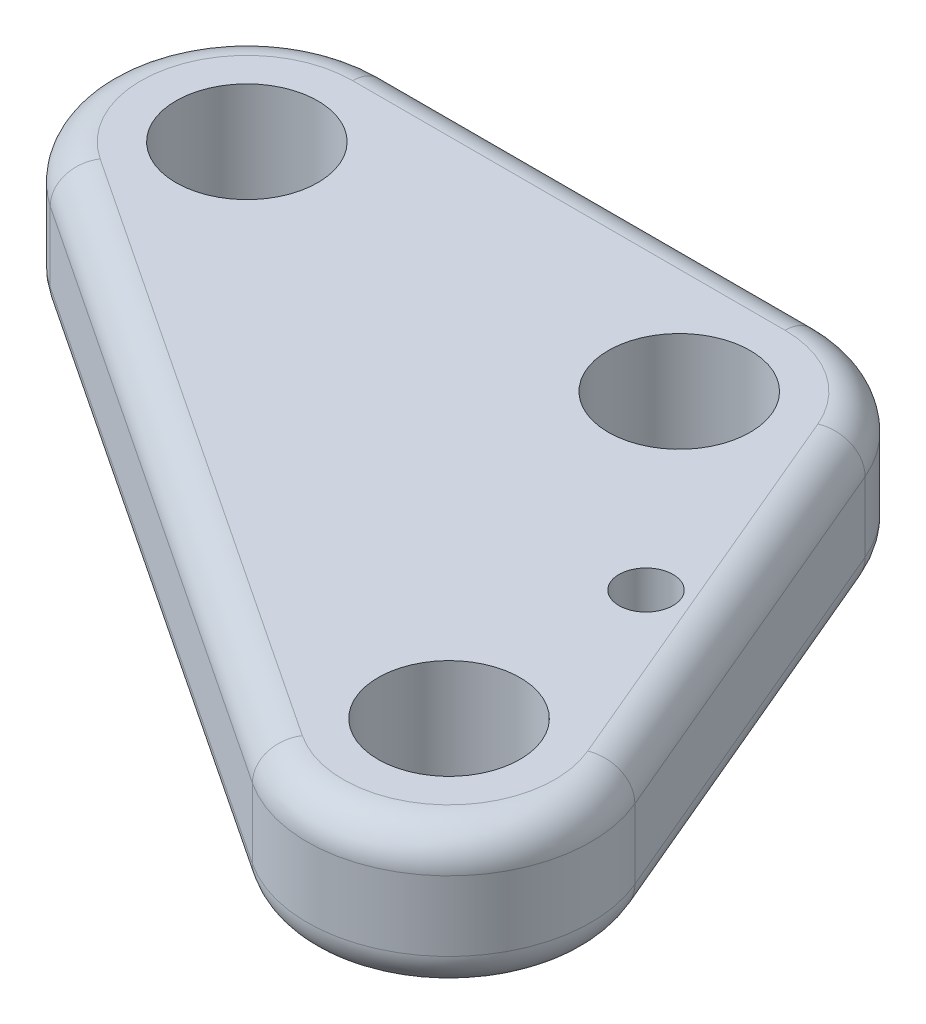
ISO-10303-21;
HEADER;
FILE_DESCRIPTION(('STEP AP214'),'2;1');
FILE_NAME('part.step','',(''),(''),'','','');
FILE_SCHEMA(('AUTOMOTIVE_DESIGN { 1 0 10303 214 1 1 1 1 }'));
ENDSEC;
DATA;
#1=APPLICATION_CONTEXT('core data for automotive mechanical design processes');
#2=APPLICATION_PROTOCOL_DEFINITION('international standard','automotive_design',2000,#1);
#3=PRODUCT_CONTEXT('',#1,'mechanical');
#4=PRODUCT('Part','Part','',(#3));
#5=PRODUCT_RELATED_PRODUCT_CATEGORY('part','',(#4));
#6=PRODUCT_DEFINITION_FORMATION('','',#4);
#7=PRODUCT_DEFINITION_CONTEXT('part definition',#1,'design');
#8=PRODUCT_DEFINITION('design','',#6,#7);
#9=PRODUCT_DEFINITION_SHAPE('','',#8);
#10=(LENGTH_UNIT() NAMED_UNIT(*) SI_UNIT(.MILLI.,.METRE.));
#11=(NAMED_UNIT(*) PLANE_ANGLE_UNIT() SI_UNIT($,.RADIAN.));
#12=(NAMED_UNIT(*) SI_UNIT($,.STERADIAN.) SOLID_ANGLE_UNIT());
#13=UNCERTAINTY_MEASURE_WITH_UNIT(LENGTH_MEASURE(1.E-05),#10,'distance_accuracy_value','');
#14=(GEOMETRIC_REPRESENTATION_CONTEXT(3) GLOBAL_UNCERTAINTY_ASSIGNED_CONTEXT((#13)) GLOBAL_UNIT_ASSIGNED_CONTEXT((#10,
#11,#12)) REPRESENTATION_CONTEXT('',''));
#15=CARTESIAN_POINT('',(0.,0.,0.));
#16=DIRECTION('',(0.,0.,1.));
#17=DIRECTION('',(1.,0.,0.));
#18=AXIS2_PLACEMENT_3D('',#15,#16,#17);
#19=CARTESIAN_POINT('',(-22.4920294512806,8.3,3.50697365111414));
#20=DIRECTION('',(0.,-1.,0.));
#21=DIRECTION('',(0.,0.,-1.));
#22=AXIS2_PLACEMENT_3D('',#19,#20,#21);
#23=PLANE('',#22);
#24=DIRECTION('',(-1.,0.,0.));
#25=VECTOR('',#24,1.);
#26=CARTESIAN_POINT('',(-22.4920294512806,8.3,-1.41662634888586));
#27=LINE('',#26,#25);
#28=CARTESIAN_POINT('',(-2.37522945128062,8.3,-1.41662634888587));
#29=VERTEX_POINT('',#28);
#30=CARTESIAN_POINT('',(-22.4920294512806,8.3,-1.41662634888586));
#31=VERTEX_POINT('',#30);
#32=EDGE_CURVE('E52',#29,#31,#27,.T.);
#33=ORIENTED_EDGE('',*,*,#32,.T.);
#34=CARTESIAN_POINT('',(-22.4920294512806,8.3,3.50697365111414));
#35=DIRECTION('',(0.,-1.,0.));
#36=DIRECTION('',(0.,0.,-1.));
#37=AXIS2_PLACEMENT_3D('',#34,#35,#36);
#38=CIRCLE('',#37,4.9236);
#39=CARTESIAN_POINT('',(-25.2136517542463,8.3,7.60997365111413));
#40=VERTEX_POINT('',#39);
#41=EDGE_CURVE('E135',#31,#40,#38,.F.);
#42=ORIENTED_EDGE('',*,*,#41,.T.);
#43=DIRECTION('',(0.833333333333333,0.,0.552770798392567));
#44=VECTOR('',#43,1.);
#45=CARTESIAN_POINT('',(-25.2136517542463,8.3,7.60997365111413));
#46=LINE('',#45,#44);
#47=CARTESIAN_POINT('',(2.72634824575375,8.3,26.1432729796201));
#48=VERTEX_POINT('',#47);
#49=EDGE_CURVE('E157',#40,#48,#46,.T.);
#50=ORIENTED_EDGE('',*,*,#49,.T.);
#51=CARTESIAN_POINT('',(5.44797054871939,8.3,22.0402729796201));
#52=DIRECTION('',(0.,-1.,0.));
#53=DIRECTION('',(0.,0.,-1.));
#54=AXIS2_PLACEMENT_3D('',#51,#52,#53);
#55=CIRCLE('',#54,4.9236);
#56=CARTESIAN_POINT('',(9.98400772032879,8.3,20.1255396462868));
#57=VERTEX_POINT('',#56);
#58=EDGE_CURVE('E273',#48,#57,#55,.F.);
#59=ORIENTED_EDGE('',*,*,#58,.T.);
#60=DIRECTION('',(-0.388888888888889,0.,-0.921284663987611));
#61=VECTOR('',#60,1.);
#62=CARTESIAN_POINT('',(-0.881547835226778,8.3,-5.61515386552708));
#63=LINE('',#62,#61);
#64=CARTESIAN_POINT('',(2.16080772032878,8.3,1.5922403177808));
#65=VERTEX_POINT('',#64);
#66=EDGE_CURVE('E275',#57,#65,#63,.T.);
#67=ORIENTED_EDGE('',*,*,#66,.T.);
#68=CARTESIAN_POINT('',(-2.37522945128062,8.3,3.50697365111414));
#69=DIRECTION('',(0.,-1.,0.));
#70=DIRECTION('',(0.,0.,-1.));
#71=AXIS2_PLACEMENT_3D('',#68,#69,#70);
#72=CIRCLE('',#71,4.9236);
#73=EDGE_CURVE('E57',#65,#29,#72,.F.);
#74=ORIENTED_EDGE('',*,*,#73,.T.);
#75=EDGE_LOOP('',(#33,#42,#50,#59,#67,#74));
#76=FACE_BOUND('',#75,.T.);
#77=CARTESIAN_POINT('',(-22.4920294512806,8.3,3.50697365111414));
#78=DIRECTION('',(0.,1.,0.));
#79=DIRECTION('',(0.,0.,1.));
#80=AXIS2_PLACEMENT_3D('',#77,#78,#79);
#81=CIRCLE('',#80,3.3);
#82=CARTESIAN_POINT('',(-22.4920294512806,8.3,6.80697365111413));
#83=VERTEX_POINT('',#82);
#84=EDGE_CURVE('E225',#83,#83,#81,.T.);
#85=ORIENTED_EDGE('',*,*,#84,.F.);
#86=EDGE_LOOP('',(#85));
#87=FACE_BOUND('',#86,.T.);
#88=CARTESIAN_POINT('',(-2.37522945128062,8.3,3.50697365111414));
#89=DIRECTION('',(0.,1.,0.));
#90=DIRECTION('',(0.,0.,1.));
#91=AXIS2_PLACEMENT_3D('',#88,#89,#90);
#92=CIRCLE('',#91,3.3);
#93=CARTESIAN_POINT('',(-2.37522945128062,8.3,6.80697365111414));
#94=VERTEX_POINT('',#93);
#95=EDGE_CURVE('E219',#94,#94,#92,.T.);
#96=ORIENTED_EDGE('',*,*,#95,.F.);
#97=EDGE_LOOP('',(#96));
#98=FACE_BOUND('',#97,.T.);
#99=CARTESIAN_POINT('',(5.44797054871939,8.3,22.0402729796201));
#100=DIRECTION('',(0.,1.,0.));
#101=DIRECTION('',(0.,0.,1.));
#102=AXIS2_PLACEMENT_3D('',#99,#100,#101);
#103=CIRCLE('',#102,3.3);
#104=CARTESIAN_POINT('',(5.44797054871939,8.3,25.3402729796201));
#105=VERTEX_POINT('',#104);
#106=EDGE_CURVE('E213',#105,#105,#103,.T.);
#107=ORIENTED_EDGE('',*,*,#106,.F.);
#108=EDGE_LOOP('',(#107));
#109=FACE_BOUND('',#108,.T.);
#110=CARTESIAN_POINT('',(4.85393277628662,8.3,12.2830441207215));
#111=DIRECTION('',(0.,1.,0.));
#112=DIRECTION('',(0.,0.,1.));
#113=AXIS2_PLACEMENT_3D('',#110,#111,#112);
#114=CIRCLE('',#113,1.2573);
#115=CARTESIAN_POINT('',(4.85393277628662,8.3,13.5403441207215));
#116=VERTEX_POINT('',#115);
#117=EDGE_CURVE('E205',#116,#116,#114,.T.);
#118=ORIENTED_EDGE('',*,*,#117,.F.);
#119=EDGE_LOOP('',(#118));
#120=FACE_BOUND('',#119,.T.);
#121=ADVANCED_FACE('F35',(#76,#87,#98,#109,#120),#23,.F.);
#122=CARTESIAN_POINT('',(-22.4920294512806,1.7,3.50697365111414));
#123=DIRECTION('',(0.,-1.,0.));
#124=DIRECTION('',(0.,0.,-1.));
#125=AXIS2_PLACEMENT_3D('',#122,#123,#124);
#126=PLANE('',#125);
#127=DIRECTION('',(0.833333333333333,0.,0.552770798392567));
#128=VECTOR('',#127,1.);
#129=CARTESIAN_POINT('',(-25.2136517542463,1.7,7.60997365111413));
#130=LINE('',#129,#128);
#131=CARTESIAN_POINT('',(2.72634824575375,1.7,26.1432729796201));
#132=VERTEX_POINT('',#131);
#133=CARTESIAN_POINT('',(-25.2136517542463,1.7,7.60997365111413));
#134=VERTEX_POINT('',#133);
#135=EDGE_CURVE('E243',#132,#134,#130,.F.);
#136=ORIENTED_EDGE('',*,*,#135,.T.);
#137=CARTESIAN_POINT('',(-22.4920294512806,1.7,3.50697365111414));
#138=DIRECTION('',(0.,-1.,0.));
#139=DIRECTION('',(0.,0.,-1.));
#140=AXIS2_PLACEMENT_3D('',#137,#138,#139);
#141=CIRCLE('',#140,4.9236);
#142=CARTESIAN_POINT('',(-22.4920294512806,1.7,-1.41662634888586));
#143=VERTEX_POINT('',#142);
#144=EDGE_CURVE('E253',#134,#143,#141,.T.);
#145=ORIENTED_EDGE('',*,*,#144,.T.);
#146=DIRECTION('',(-1.,0.,0.));
#147=VECTOR('',#146,1.);
#148=CARTESIAN_POINT('',(-2.37522945128062,1.7,-1.41662634888586));
#149=LINE('',#148,#147);
#150=CARTESIAN_POINT('',(-2.37522945128062,1.7,-1.41662634888587));
#151=VERTEX_POINT('',#150);
#152=EDGE_CURVE('E251',#143,#151,#149,.F.);
#153=ORIENTED_EDGE('',*,*,#152,.T.);
#154=CARTESIAN_POINT('',(-2.37522945128062,1.7,3.50697365111414));
#155=DIRECTION('',(0.,-1.,0.));
#156=DIRECTION('',(0.,0.,-1.));
#157=AXIS2_PLACEMENT_3D('',#154,#155,#156);
#158=CIRCLE('',#157,4.9236);
#159=CARTESIAN_POINT('',(2.16080772032878,1.7,1.5922403177808));
#160=VERTEX_POINT('',#159);
#161=EDGE_CURVE('E249',#151,#160,#158,.T.);
#162=ORIENTED_EDGE('',*,*,#161,.T.);
#163=DIRECTION('',(-0.388888888888889,0.,-0.921284663987611));
#164=VECTOR('',#163,1.);
#165=CARTESIAN_POINT('',(9.98400772032879,1.7,20.1255396462868));
#166=LINE('',#165,#164);
#167=CARTESIAN_POINT('',(9.98400772032879,1.7,20.1255396462868));
#168=VERTEX_POINT('',#167);
#169=EDGE_CURVE('E247',#160,#168,#166,.F.);
#170=ORIENTED_EDGE('',*,*,#169,.T.);
#171=CARTESIAN_POINT('',(5.44797054871939,1.7,22.0402729796201));
#172=DIRECTION('',(0.,-1.,0.));
#173=DIRECTION('',(0.,0.,-1.));
#174=AXIS2_PLACEMENT_3D('',#171,#172,#173);
#175=CIRCLE('',#174,4.9236);
#176=EDGE_CURVE('E245',#168,#132,#175,.T.);
#177=ORIENTED_EDGE('',*,*,#176,.T.);
#178=EDGE_LOOP('',(#136,#145,#153,#162,#170,#177));
#179=FACE_BOUND('',#178,.T.);
#180=CARTESIAN_POINT('',(5.44797054871939,1.7,22.0402729796201));
#181=DIRECTION('',(0.,1.,0.));
#182=DIRECTION('',(0.,0.,1.));
#183=AXIS2_PLACEMENT_3D('',#180,#181,#182);
#184=CIRCLE('',#183,3.3);
#185=CARTESIAN_POINT('',(5.44797054871939,1.7,25.3402729796201));
#186=VERTEX_POINT('',#185);
#187=EDGE_CURVE('E210',#186,#186,#184,.T.);
#188=ORIENTED_EDGE('',*,*,#187,.T.);
#189=EDGE_LOOP('',(#188));
#190=FACE_BOUND('',#189,.T.);
#191=CARTESIAN_POINT('',(-22.4920294512806,1.7,3.50697365111414));
#192=DIRECTION('',(0.,1.,0.));
#193=DIRECTION('',(0.,0.,1.));
#194=AXIS2_PLACEMENT_3D('',#191,#192,#193);
#195=CIRCLE('',#194,3.3);
#196=CARTESIAN_POINT('',(-22.4920294512806,1.7,6.80697365111413));
#197=VERTEX_POINT('',#196);
#198=EDGE_CURVE('E222',#197,#197,#195,.T.);
#199=ORIENTED_EDGE('',*,*,#198,.T.);
#200=EDGE_LOOP('',(#199));
#201=FACE_BOUND('',#200,.T.);
#202=CARTESIAN_POINT('',(-2.37522945128062,1.7,3.50697365111414));
#203=DIRECTION('',(0.,1.,0.));
#204=DIRECTION('',(0.,0.,1.));
#205=AXIS2_PLACEMENT_3D('',#202,#203,#204);
#206=CIRCLE('',#205,3.3);
#207=CARTESIAN_POINT('',(-2.37522945128062,1.7,6.80697365111414));
#208=VERTEX_POINT('',#207);
#209=EDGE_CURVE('E216',#208,#208,#206,.T.);
#210=ORIENTED_EDGE('',*,*,#209,.T.);
#211=EDGE_LOOP('',(#210));
#212=FACE_BOUND('',#211,.T.);
#213=CARTESIAN_POINT('',(4.85393277628662,1.7,12.2830441207215));
#214=DIRECTION('',(0.,1.,0.));
#215=DIRECTION('',(0.,0.,1.));
#216=AXIS2_PLACEMENT_3D('',#213,#214,#215);
#217=CIRCLE('',#216,1.2573);
#218=CARTESIAN_POINT('',(4.85393277628662,1.7,13.5403441207215));
#219=VERTEX_POINT('',#218);
#220=EDGE_CURVE('E199',#219,#219,#217,.T.);
#221=ORIENTED_EDGE('',*,*,#220,.T.);
#222=EDGE_LOOP('',(#221));
#223=FACE_BOUND('',#222,.T.);
#224=ADVANCED_FACE('F317',(#179,#190,#201,#212,#223),#126,.T.);
#225=CARTESIAN_POINT('',(-22.4920294512806,8.3,3.50697365111414));
#226=DIRECTION('',(0.,-1.,0.));
#227=DIRECTION('',(0.,0.,-1.));
#228=AXIS2_PLACEMENT_3D('',#225,#226,#227);
#229=CYLINDRICAL_SURFACE('',#228,6.6);
#230=DIRECTION('',(0.,-1.,0.));
#231=VECTOR('',#230,1.);
#232=CARTESIAN_POINT('',(-22.4920294512806,8.3,-3.09302634888586));
#233=LINE('',#232,#231);
#234=CARTESIAN_POINT('',(-22.4920294512806,6.6236,-3.09302634888586));
#235=VERTEX_POINT('',#234);
#236=CARTESIAN_POINT('',(-22.4920294512806,3.3764,-3.09302634888586));
#237=VERTEX_POINT('',#236);
#238=EDGE_CURVE('E228',#235,#237,#233,.T.);
#239=ORIENTED_EDGE('',*,*,#238,.T.);
#240=CARTESIAN_POINT('',(-22.4920294512806,3.3764,3.50697365111414));
#241=DIRECTION('',(0.,-1.,0.));
#242=DIRECTION('',(0.,0.,-1.));
#243=AXIS2_PLACEMENT_3D('',#240,#241,#242);
#244=CIRCLE('',#243,6.6);
#245=CARTESIAN_POINT('',(-26.1403167206716,3.3764,9.00697365111413));
#246=VERTEX_POINT('',#245);
#247=EDGE_CURVE('E146',#237,#246,#244,.F.);
#248=ORIENTED_EDGE('',*,*,#247,.T.);
#249=DIRECTION('',(0.,-1.,0.));
#250=VECTOR('',#249,1.);
#251=CARTESIAN_POINT('',(-26.1403167206716,8.3,9.00697365111413));
#252=LINE('',#251,#250);
#253=CARTESIAN_POINT('',(-26.1403167206716,6.6236,9.00697365111413));
#254=VERTEX_POINT('',#253);
#255=EDGE_CURVE('E128',#254,#246,#252,.T.);
#256=ORIENTED_EDGE('',*,*,#255,.F.);
#257=CARTESIAN_POINT('',(-22.4920294512806,6.6236,3.50697365111414));
#258=DIRECTION('',(0.,-1.,0.));
#259=DIRECTION('',(0.,0.,-1.));
#260=AXIS2_PLACEMENT_3D('',#257,#258,#259);
#261=CIRCLE('',#260,6.6);
#262=EDGE_CURVE('E143',#254,#235,#261,.T.);
#263=ORIENTED_EDGE('',*,*,#262,.T.);
#264=EDGE_LOOP('',(#239,#248,#256,#263));
#265=FACE_BOUND('',#264,.T.);
#266=ADVANCED_FACE('F142',(#265),#229,.T.);
#267=CARTESIAN_POINT('',(-26.1403167206716,8.3,9.00697365111413));
#268=DIRECTION('',(0.552770798392567,0.,-0.833333333333333));
#269=DIRECTION('',(-0.833333333333333,0.,-0.552770798392567));
#270=AXIS2_PLACEMENT_3D('',#267,#268,#269);
#271=PLANE('',#270);
#272=ORIENTED_EDGE('',*,*,#255,.T.);
#273=DIRECTION('',(0.833333333333333,0.,0.552770798392567));
#274=VECTOR('',#273,1.);
#275=CARTESIAN_POINT('',(1.79968327932845,3.3764,27.5402729796201));
#276=LINE('',#275,#274);
#277=CARTESIAN_POINT('',(1.79968327932845,3.3764,27.5402729796201));
#278=VERTEX_POINT('',#277);
#279=EDGE_CURVE('E11',#246,#278,#276,.T.);
#280=ORIENTED_EDGE('',*,*,#279,.T.);
#281=DIRECTION('',(0.,-1.,0.));
#282=VECTOR('',#281,1.);
#283=CARTESIAN_POINT('',(1.79968327932845,8.3,27.5402729796201));
#284=LINE('',#283,#282);
#285=CARTESIAN_POINT('',(1.79968327932845,6.6236,27.5402729796201));
#286=VERTEX_POINT('',#285);
#287=EDGE_CURVE('E130',#286,#278,#284,.T.);
#288=ORIENTED_EDGE('',*,*,#287,.F.);
#289=DIRECTION('',(0.833333333333333,0.,0.552770798392567));
#290=VECTOR('',#289,1.);
#291=CARTESIAN_POINT('',(-26.1403167206716,6.6236,9.00697365111413));
#292=LINE('',#291,#290);
#293=EDGE_CURVE('E44',#286,#254,#292,.F.);
#294=ORIENTED_EDGE('',*,*,#293,.T.);
#295=EDGE_LOOP('',(#272,#280,#288,#294));
#296=FACE_BOUND('',#295,.T.);
#297=ADVANCED_FACE('F127',(#296),#271,.F.);
#298=CARTESIAN_POINT('',(5.44797054871939,8.3,22.0402729796201));
#299=DIRECTION('',(0.,-1.,0.));
#300=DIRECTION('',(0.,0.,-1.));
#301=AXIS2_PLACEMENT_3D('',#298,#299,#300);
#302=CYLINDRICAL_SURFACE('',#301,6.6);
#303=ORIENTED_EDGE('',*,*,#287,.T.);
#304=CARTESIAN_POINT('',(5.44797054871939,3.3764,22.0402729796201));
#305=DIRECTION('',(0.,-1.,0.));
#306=DIRECTION('',(0.,0.,-1.));
#307=AXIS2_PLACEMENT_3D('',#304,#305,#306);
#308=CIRCLE('',#307,6.6);
#309=CARTESIAN_POINT('',(11.5284493310376,3.3764,19.4736063129534));
#310=VERTEX_POINT('',#309);
#311=EDGE_CURVE('E270',#278,#310,#308,.F.);
#312=ORIENTED_EDGE('',*,*,#311,.T.);
#313=DIRECTION('',(0.,-1.,0.));
#314=VECTOR('',#313,1.);
#315=CARTESIAN_POINT('',(11.5284493310376,8.3,19.4736063129534));
#316=LINE('',#315,#314);
#317=CARTESIAN_POINT('',(11.5284493310376,6.6236,19.4736063129534));
#318=VERTEX_POINT('',#317);
#319=EDGE_CURVE('E238',#318,#310,#316,.T.);
#320=ORIENTED_EDGE('',*,*,#319,.F.);
#321=CARTESIAN_POINT('',(5.44797054871939,6.6236,22.0402729796201));
#322=DIRECTION('',(0.,-1.,0.));
#323=DIRECTION('',(0.,0.,-1.));
#324=AXIS2_PLACEMENT_3D('',#321,#322,#323);
#325=CIRCLE('',#324,6.6);
#326=EDGE_CURVE('E268',#318,#286,#325,.T.);
#327=ORIENTED_EDGE('',*,*,#326,.T.);
#328=EDGE_LOOP('',(#303,#312,#320,#327));
#329=FACE_BOUND('',#328,.T.);
#330=ADVANCED_FACE('F284',(#329),#302,.T.);
#331=CARTESIAN_POINT('',(11.5284493310376,8.3,19.4736063129534));
#332=DIRECTION('',(-0.921284663987611,0.,0.388888888888889));
#333=DIRECTION('',(0.388888888888889,0.,0.921284663987611));
#334=AXIS2_PLACEMENT_3D('',#331,#332,#333);
#335=PLANE('',#334);
#336=ORIENTED_EDGE('',*,*,#319,.T.);
#337=DIRECTION('',(-0.388888888888889,0.,-0.921284663987611));
#338=VECTOR('',#337,1.);
#339=CARTESIAN_POINT('',(3.70524933103762,3.3764,0.940306984447469));
#340=LINE('',#339,#338);
#341=CARTESIAN_POINT('',(3.70524933103761,3.3764,0.940306984447466));
#342=VERTEX_POINT('',#341);
#343=EDGE_CURVE('E266',#310,#342,#340,.T.);
#344=ORIENTED_EDGE('',*,*,#343,.T.);
#345=DIRECTION('',(0.,-1.,0.));
#346=VECTOR('',#345,1.);
#347=CARTESIAN_POINT('',(3.70524933103761,8.3,0.940306984447466));
#348=LINE('',#347,#346);
#349=CARTESIAN_POINT('',(3.70524933103761,6.6236,0.940306984447466));
#350=VERTEX_POINT('',#349);
#351=EDGE_CURVE('E235',#350,#342,#348,.T.);
#352=ORIENTED_EDGE('',*,*,#351,.F.);
#353=DIRECTION('',(-0.388888888888889,0.,-0.921284663987611));
#354=VECTOR('',#353,1.);
#355=CARTESIAN_POINT('',(11.5284493310376,6.6236,19.4736063129534));
#356=LINE('',#355,#354);
#357=EDGE_CURVE('E264',#350,#318,#356,.F.);
#358=ORIENTED_EDGE('',*,*,#357,.T.);
#359=EDGE_LOOP('',(#336,#344,#352,#358));
#360=FACE_BOUND('',#359,.T.);
#361=ADVANCED_FACE('F332',(#360),#335,.F.);
#362=CARTESIAN_POINT('',(-2.37522945128062,8.3,3.50697365111414));
#363=DIRECTION('',(0.,-1.,0.));
#364=DIRECTION('',(0.,0.,-1.));
#365=AXIS2_PLACEMENT_3D('',#362,#363,#364);
#366=CYLINDRICAL_SURFACE('',#365,6.6);
#367=ORIENTED_EDGE('',*,*,#351,.T.);
#368=CARTESIAN_POINT('',(-2.37522945128062,3.3764,3.50697365111414));
#369=DIRECTION('',(0.,-1.,0.));
#370=DIRECTION('',(0.,0.,-1.));
#371=AXIS2_PLACEMENT_3D('',#368,#369,#370);
#372=CIRCLE('',#371,6.6);
#373=CARTESIAN_POINT('',(-2.37522945128062,3.3764,-3.09302634888587));
#374=VERTEX_POINT('',#373);
#375=EDGE_CURVE('E262',#342,#374,#372,.F.);
#376=ORIENTED_EDGE('',*,*,#375,.T.);
#377=DIRECTION('',(0.,-1.,0.));
#378=VECTOR('',#377,1.);
#379=CARTESIAN_POINT('',(-2.37522945128062,8.3,-3.09302634888587));
#380=LINE('',#379,#378);
#381=CARTESIAN_POINT('',(-2.37522945128062,6.6236,-3.09302634888587));
#382=VERTEX_POINT('',#381);
#383=EDGE_CURVE('E232',#382,#374,#380,.T.);
#384=ORIENTED_EDGE('',*,*,#383,.F.);
#385=CARTESIAN_POINT('',(-2.37522945128062,6.6236,3.50697365111414));
#386=DIRECTION('',(0.,-1.,0.));
#387=DIRECTION('',(0.,0.,-1.));
#388=AXIS2_PLACEMENT_3D('',#385,#386,#387);
#389=CIRCLE('',#388,6.6);
#390=EDGE_CURVE('E260',#382,#350,#389,.T.);
#391=ORIENTED_EDGE('',*,*,#390,.T.);
#392=EDGE_LOOP('',(#367,#376,#384,#391));
#393=FACE_BOUND('',#392,.T.);
#394=ADVANCED_FACE('F297',(#393),#366,.T.);
#395=CARTESIAN_POINT('',(-22.4920294512806,8.3,-3.09302634888586));
#396=DIRECTION('',(0.,0.,1.));
#397=DIRECTION('',(1.,0.,0.));
#398=AXIS2_PLACEMENT_3D('',#395,#396,#397);
#399=PLANE('',#398);
#400=ORIENTED_EDGE('',*,*,#383,.T.);
#401=DIRECTION('',(-1.,0.,0.));
#402=VECTOR('',#401,1.);
#403=CARTESIAN_POINT('',(-22.4920294512806,3.3764,-3.09302634888586));
#404=LINE('',#403,#402);
#405=EDGE_CURVE('E258',#374,#237,#404,.T.);
#406=ORIENTED_EDGE('',*,*,#405,.T.);
#407=ORIENTED_EDGE('',*,*,#238,.F.);
#408=DIRECTION('',(-1.,0.,0.));
#409=VECTOR('',#408,1.);
#410=CARTESIAN_POINT('',(-22.4920294512806,6.6236,-3.09302634888586));
#411=LINE('',#410,#409);
#412=EDGE_CURVE('E256',#235,#382,#411,.F.);
#413=ORIENTED_EDGE('',*,*,#412,.T.);
#414=EDGE_LOOP('',(#400,#406,#407,#413));
#415=FACE_BOUND('',#414,.T.);
#416=ADVANCED_FACE('F294',(#415),#399,.F.);
#417=CARTESIAN_POINT('',(-22.4920294512806,8.3,3.50697365111414));
#418=DIRECTION('',(0.,-1.,0.));
#419=DIRECTION('',(0.,0.,-1.));
#420=AXIS2_PLACEMENT_3D('',#417,#418,#419);
#421=CYLINDRICAL_SURFACE('',#420,3.3);
#422=ORIENTED_EDGE('',*,*,#84,.T.);
#423=EDGE_LOOP('',(#422));
#424=FACE_BOUND('',#423,.T.);
#425=ORIENTED_EDGE('',*,*,#198,.F.);
#426=EDGE_LOOP('',(#425));
#427=FACE_BOUND('',#426,.T.);
#428=ADVANCED_FACE('F325',(#424,#427),#421,.F.);
#429=CARTESIAN_POINT('',(-2.37522945128062,8.3,3.50697365111414));
#430=DIRECTION('',(0.,-1.,0.));
#431=DIRECTION('',(0.,0.,-1.));
#432=AXIS2_PLACEMENT_3D('',#429,#430,#431);
#433=CYLINDRICAL_SURFACE('',#432,3.3);
#434=ORIENTED_EDGE('',*,*,#95,.T.);
#435=EDGE_LOOP('',(#434));
#436=FACE_BOUND('',#435,.T.);
#437=ORIENTED_EDGE('',*,*,#209,.F.);
#438=EDGE_LOOP('',(#437));
#439=FACE_BOUND('',#438,.T.);
#440=ADVANCED_FACE('F369',(#436,#439),#433,.F.);
#441=CARTESIAN_POINT('',(5.44797054871939,8.3,22.0402729796201));
#442=DIRECTION('',(0.,-1.,0.));
#443=DIRECTION('',(0.,0.,-1.));
#444=AXIS2_PLACEMENT_3D('',#441,#442,#443);
#445=CYLINDRICAL_SURFACE('',#444,3.3);
#446=ORIENTED_EDGE('',*,*,#106,.T.);
#447=EDGE_LOOP('',(#446));
#448=FACE_BOUND('',#447,.T.);
#449=ORIENTED_EDGE('',*,*,#187,.F.);
#450=EDGE_LOOP('',(#449));
#451=FACE_BOUND('',#450,.T.);
#452=ADVANCED_FACE('F376',(#448,#451),#445,.F.);
#453=CARTESIAN_POINT('',(4.85393277628662,8.3,12.2830441207215));
#454=DIRECTION('',(0.,-1.,0.));
#455=DIRECTION('',(0.,0.,-1.));
#456=AXIS2_PLACEMENT_3D('',#453,#454,#455);
#457=CYLINDRICAL_SURFACE('',#456,1.2573);
#458=ORIENTED_EDGE('',*,*,#117,.T.);
#459=EDGE_LOOP('',(#458));
#460=FACE_BOUND('',#459,.T.);
#461=ORIENTED_EDGE('',*,*,#220,.F.);
#462=EDGE_LOOP('',(#461));
#463=FACE_BOUND('',#462,.T.);
#464=ADVANCED_FACE('F383',(#460,#463),#457,.F.);
#465=CARTESIAN_POINT('',(9.98400772032879,3.3764,20.1255396462868));
#466=DIRECTION('',(0.388888888888889,0.,0.921284663987611));
#467=DIRECTION('',(0.921284663987611,0.,-0.388888888888889));
#468=AXIS2_PLACEMENT_3D('',#465,#466,#467);
#469=CYLINDRICAL_SURFACE('',#468,1.6764);
#470=CARTESIAN_POINT('',(9.98400772032879,3.3764,20.1255396462868));
#471=DIRECTION('',(0.388888888888889,0.,0.921284663987611));
#472=DIRECTION('',(0.921284663987611,0.,-0.388888888888889));
#473=AXIS2_PLACEMENT_3D('',#470,#471,#472);
#474=CIRCLE('',#473,1.6764);
#475=EDGE_CURVE('E192',#168,#310,#474,.T.);
#476=ORIENTED_EDGE('',*,*,#475,.F.);
#477=ORIENTED_EDGE('',*,*,#169,.F.);
#478=CARTESIAN_POINT('',(2.16080772032878,3.3764,1.5922403177808));
#479=DIRECTION('',(-0.388888888888889,0.,-0.921284663987611));
#480=DIRECTION('',(-0.921284663987611,0.,0.388888888888889));
#481=AXIS2_PLACEMENT_3D('',#478,#479,#480);
#482=CIRCLE('',#481,1.6764);
#483=EDGE_CURVE('E162',#342,#160,#482,.T.);
#484=ORIENTED_EDGE('',*,*,#483,.F.);
#485=ORIENTED_EDGE('',*,*,#343,.F.);
#486=EDGE_LOOP('',(#476,#477,#484,#485));
#487=FACE_BOUND('',#486,.T.);
#488=ADVANCED_FACE('F391',(#487),#469,.T.);
#489=CARTESIAN_POINT('',(-2.37522945128062,3.3764,3.50697365111414));
#490=DIRECTION('',(0.,-1.,0.));
#491=DIRECTION('',(0.,0.,-1.));
#492=AXIS2_PLACEMENT_3D('',#489,#490,#491);
#493=TOROIDAL_SURFACE('',#492,4.9236,1.6764);
#494=ORIENTED_EDGE('',*,*,#483,.T.);
#495=ORIENTED_EDGE('',*,*,#161,.F.);
#496=CARTESIAN_POINT('',(-2.37522945128062,3.3764,-1.41662634888587));
#497=DIRECTION('',(-1.,0.,0.));
#498=DIRECTION('',(0.,-1.,0.));
#499=AXIS2_PLACEMENT_3D('',#496,#497,#498);
#500=CIRCLE('',#499,1.6764);
#501=EDGE_CURVE('E190',#374,#151,#500,.T.);
#502=ORIENTED_EDGE('',*,*,#501,.F.);
#503=ORIENTED_EDGE('',*,*,#375,.F.);
#504=EDGE_LOOP('',(#494,#495,#502,#503));
#505=FACE_BOUND('',#504,.T.);
#506=ADVANCED_FACE('F299',(#505),#493,.T.);
#507=CARTESIAN_POINT('',(5.44797054871939,3.3764,22.0402729796201));
#508=DIRECTION('',(0.,-1.,0.));
#509=DIRECTION('',(0.,0.,-1.));
#510=AXIS2_PLACEMENT_3D('',#507,#508,#509);
#511=TOROIDAL_SURFACE('',#510,4.9236,1.6764);
#512=ORIENTED_EDGE('',*,*,#475,.T.);
#513=ORIENTED_EDGE('',*,*,#311,.F.);
#514=CARTESIAN_POINT('',(2.72634824575374,3.3764,26.1432729796201));
#515=DIRECTION('',(-0.833333333333333,0.,-0.552770798392566));
#516=DIRECTION('',(-0.552770798392567,0.,0.833333333333333));
#517=AXIS2_PLACEMENT_3D('',#514,#515,#516);
#518=CIRCLE('',#517,1.6764);
#519=EDGE_CURVE('E185',#132,#278,#518,.T.);
#520=ORIENTED_EDGE('',*,*,#519,.F.);
#521=ORIENTED_EDGE('',*,*,#176,.F.);
#522=EDGE_LOOP('',(#512,#513,#520,#521));
#523=FACE_BOUND('',#522,.T.);
#524=ADVANCED_FACE('F406',(#523),#511,.T.);
#525=CARTESIAN_POINT('',(-22.4920294512806,3.3764,-1.41662634888586));
#526=DIRECTION('',(1.,0.,0.));
#527=DIRECTION('',(0.,0.,-1.));
#528=AXIS2_PLACEMENT_3D('',#525,#526,#527);
#529=CYLINDRICAL_SURFACE('',#528,1.6764);
#530=ORIENTED_EDGE('',*,*,#501,.T.);
#531=ORIENTED_EDGE('',*,*,#152,.F.);
#532=CARTESIAN_POINT('',(-22.4920294512806,3.3764,-1.41662634888586));
#533=DIRECTION('',(-1.,0.,0.));
#534=DIRECTION('',(0.,0.,1.));
#535=AXIS2_PLACEMENT_3D('',#532,#533,#534);
#536=CIRCLE('',#535,1.6764);
#537=EDGE_CURVE('E179',#237,#143,#536,.T.);
#538=ORIENTED_EDGE('',*,*,#537,.F.);
#539=ORIENTED_EDGE('',*,*,#405,.F.);
#540=EDGE_LOOP('',(#530,#531,#538,#539));
#541=FACE_BOUND('',#540,.T.);
#542=ADVANCED_FACE('F304',(#541),#529,.T.);
#543=CARTESIAN_POINT('',(-25.2136517542463,3.3764,7.60997365111413));
#544=DIRECTION('',(-0.833333333333333,0.,-0.552770798392567));
#545=DIRECTION('',(-0.552770798392567,0.,0.833333333333333));
#546=AXIS2_PLACEMENT_3D('',#543,#544,#545);
#547=CYLINDRICAL_SURFACE('',#546,1.6764);
#548=ORIENTED_EDGE('',*,*,#519,.T.);
#549=ORIENTED_EDGE('',*,*,#279,.F.);
#550=CARTESIAN_POINT('',(-25.2136517542463,3.3764,7.60997365111413));
#551=DIRECTION('',(-0.833333333333333,0.,-0.552770798392567));
#552=DIRECTION('',(-0.552770798392567,0.,0.833333333333333));
#553=AXIS2_PLACEMENT_3D('',#550,#551,#552);
#554=CIRCLE('',#553,1.6764);
#555=EDGE_CURVE('E175',#134,#246,#554,.T.);
#556=ORIENTED_EDGE('',*,*,#555,.F.);
#557=ORIENTED_EDGE('',*,*,#135,.F.);
#558=EDGE_LOOP('',(#548,#549,#556,#557));
#559=FACE_BOUND('',#558,.T.);
#560=ADVANCED_FACE('F307',(#559),#547,.T.);
#561=CARTESIAN_POINT('',(-22.4920294512806,3.3764,3.50697365111414));
#562=DIRECTION('',(0.,-1.,0.));
#563=DIRECTION('',(0.,0.,-1.));
#564=AXIS2_PLACEMENT_3D('',#561,#562,#563);
#565=TOROIDAL_SURFACE('',#564,4.9236,1.6764);
#566=ORIENTED_EDGE('',*,*,#537,.T.);
#567=ORIENTED_EDGE('',*,*,#144,.F.);
#568=ORIENTED_EDGE('',*,*,#555,.T.);
#569=ORIENTED_EDGE('',*,*,#247,.F.);
#570=EDGE_LOOP('',(#566,#567,#568,#569));
#571=FACE_BOUND('',#570,.T.);
#572=ADVANCED_FACE('F305',(#571),#565,.T.);
#573=CARTESIAN_POINT('',(-0.881547835226773,6.6236,-5.61515386552708));
#574=DIRECTION('',(-0.388888888888889,0.,-0.921284663987611));
#575=DIRECTION('',(-0.921284663987611,0.,0.388888888888889));
#576=AXIS2_PLACEMENT_3D('',#573,#574,#575);
#577=CYLINDRICAL_SURFACE('',#576,1.6764);
#578=CARTESIAN_POINT('',(9.98400772032879,6.6236,20.1255396462868));
#579=DIRECTION('',(0.388888888888889,0.,0.921284663987611));
#580=DIRECTION('',(0.921284663987611,0.,-0.388888888888889));
#581=AXIS2_PLACEMENT_3D('',#578,#579,#580);
#582=CIRCLE('',#581,1.6764);
#583=EDGE_CURVE('E168',#318,#57,#582,.T.);
#584=ORIENTED_EDGE('',*,*,#583,.F.);
#585=ORIENTED_EDGE('',*,*,#357,.F.);
#586=CARTESIAN_POINT('',(2.16080772032878,6.6236,1.5922403177808));
#587=DIRECTION('',(-0.388888888888889,0.,-0.921284663987611));
#588=DIRECTION('',(-0.921284663987611,0.,0.388888888888889));
#589=AXIS2_PLACEMENT_3D('',#586,#587,#588);
#590=CIRCLE('',#589,1.6764);
#591=EDGE_CURVE('E39',#65,#350,#590,.T.);
#592=ORIENTED_EDGE('',*,*,#591,.F.);
#593=ORIENTED_EDGE('',*,*,#66,.F.);
#594=EDGE_LOOP('',(#584,#585,#592,#593));
#595=FACE_BOUND('',#594,.T.);
#596=ADVANCED_FACE('F37',(#595),#577,.T.);
#597=CARTESIAN_POINT('',(-2.37522945128062,6.6236,3.50697365111414));
#598=DIRECTION('',(0.,-1.,0.));
#599=DIRECTION('',(0.,0.,-1.));
#600=AXIS2_PLACEMENT_3D('',#597,#598,#599);
#601=TOROIDAL_SURFACE('',#600,4.9236,1.6764);
#602=ORIENTED_EDGE('',*,*,#591,.T.);
#603=ORIENTED_EDGE('',*,*,#390,.F.);
#604=CARTESIAN_POINT('',(-2.37522945128062,6.6236,-1.41662634888587));
#605=DIRECTION('',(-1.,0.,0.));
#606=DIRECTION('',(0.,0.,1.));
#607=AXIS2_PLACEMENT_3D('',#604,#605,#606);
#608=CIRCLE('',#607,1.6764);
#609=EDGE_CURVE('E166',#29,#382,#608,.T.);
#610=ORIENTED_EDGE('',*,*,#609,.F.);
#611=ORIENTED_EDGE('',*,*,#73,.F.);
#612=EDGE_LOOP('',(#602,#603,#610,#611));
#613=FACE_BOUND('',#612,.T.);
#614=ADVANCED_FACE('F289',(#613),#601,.T.);
#615=CARTESIAN_POINT('',(5.44797054871939,6.6236,22.0402729796201));
#616=DIRECTION('',(0.,-1.,0.));
#617=DIRECTION('',(0.,0.,-1.));
#618=AXIS2_PLACEMENT_3D('',#615,#616,#617);
#619=TOROIDAL_SURFACE('',#618,4.9236,1.6764);
#620=ORIENTED_EDGE('',*,*,#583,.T.);
#621=ORIENTED_EDGE('',*,*,#58,.F.);
#622=CARTESIAN_POINT('',(2.72634824575375,6.6236,26.1432729796201));
#623=DIRECTION('',(-0.833333333333334,0.,-0.552770798392566));
#624=DIRECTION('',(-0.552770798392566,0.,0.833333333333334));
#625=AXIS2_PLACEMENT_3D('',#622,#623,#624);
#626=CIRCLE('',#625,1.6764);
#627=EDGE_CURVE('E159',#286,#48,#626,.T.);
#628=ORIENTED_EDGE('',*,*,#627,.F.);
#629=ORIENTED_EDGE('',*,*,#326,.F.);
#630=EDGE_LOOP('',(#620,#621,#628,#629));
#631=FACE_BOUND('',#630,.T.);
#632=ADVANCED_FACE('F281',(#631),#619,.T.);
#633=CARTESIAN_POINT('',(-22.4920294512806,6.6236,-1.41662634888586));
#634=DIRECTION('',(-1.,0.,0.));
#635=DIRECTION('',(0.,0.,1.));
#636=AXIS2_PLACEMENT_3D('',#633,#634,#635);
#637=CYLINDRICAL_SURFACE('',#636,1.6764);
#638=ORIENTED_EDGE('',*,*,#609,.T.);
#639=ORIENTED_EDGE('',*,*,#412,.F.);
#640=CARTESIAN_POINT('',(-22.4920294512806,6.6236,-1.41662634888586));
#641=DIRECTION('',(-1.,0.,0.));
#642=DIRECTION('',(0.,0.,1.));
#643=AXIS2_PLACEMENT_3D('',#640,#641,#642);
#644=CIRCLE('',#643,1.6764);
#645=EDGE_CURVE('E153',#31,#235,#644,.T.);
#646=ORIENTED_EDGE('',*,*,#645,.F.);
#647=ORIENTED_EDGE('',*,*,#32,.F.);
#648=EDGE_LOOP('',(#638,#639,#646,#647));
#649=FACE_BOUND('',#648,.T.);
#650=ADVANCED_FACE('F291',(#649),#637,.T.);
#651=CARTESIAN_POINT('',(-25.2136517542463,6.6236,7.60997365111413));
#652=DIRECTION('',(0.833333333333333,0.,0.552770798392567));
#653=DIRECTION('',(0.552770798392567,0.,-0.833333333333333));
#654=AXIS2_PLACEMENT_3D('',#651,#652,#653);
#655=CYLINDRICAL_SURFACE('',#654,1.6764);
#656=ORIENTED_EDGE('',*,*,#627,.T.);
#657=ORIENTED_EDGE('',*,*,#49,.F.);
#658=CARTESIAN_POINT('',(-25.2136517542463,6.6236,7.60997365111413));
#659=DIRECTION('',(-0.833333333333333,0.,-0.552770798392567));
#660=DIRECTION('',(-0.552770798392567,0.,0.833333333333333));
#661=AXIS2_PLACEMENT_3D('',#658,#659,#660);
#662=CIRCLE('',#661,1.6764);
#663=EDGE_CURVE('E151',#254,#40,#662,.T.);
#664=ORIENTED_EDGE('',*,*,#663,.F.);
#665=ORIENTED_EDGE('',*,*,#293,.F.);
#666=EDGE_LOOP('',(#656,#657,#664,#665));
#667=FACE_BOUND('',#666,.T.);
#668=ADVANCED_FACE('F156',(#667),#655,.T.);
#669=CARTESIAN_POINT('',(-22.4920294512806,6.6236,3.50697365111414));
#670=DIRECTION('',(0.,-1.,0.));
#671=DIRECTION('',(0.,0.,-1.));
#672=AXIS2_PLACEMENT_3D('',#669,#670,#671);
#673=TOROIDAL_SURFACE('',#672,4.9236,1.6764);
#674=ORIENTED_EDGE('',*,*,#645,.T.);
#675=ORIENTED_EDGE('',*,*,#262,.F.);
#676=ORIENTED_EDGE('',*,*,#663,.T.);
#677=ORIENTED_EDGE('',*,*,#41,.F.);
#678=EDGE_LOOP('',(#674,#675,#676,#677));
#679=FACE_BOUND('',#678,.T.);
#680=ADVANCED_FACE('F149',(#679),#673,.T.);
#681=CLOSED_SHELL('',(#121,#224,#266,#297,#330,#361,#394,#416,#428,#440,#452,#464,#488,#506,
#524,#542,#560,#572,#596,#614,#632,#650,#668,#680));
#682=MANIFOLD_SOLID_BREP('B2',#681);
#683=ADVANCED_BREP_SHAPE_REPRESENTATION('',(#18,#682),#14);
#684=SHAPE_DEFINITION_REPRESENTATION(#9,#683);
ENDSEC;
END-ISO-10303-21;
